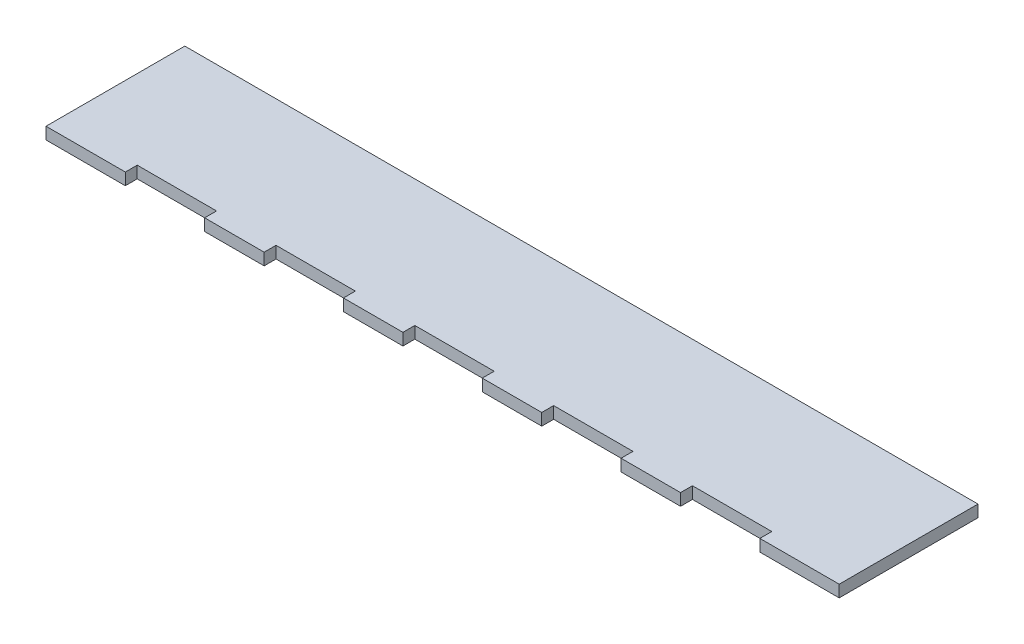
ISO-10303-21;
HEADER;
FILE_DESCRIPTION(('STEP AP214'),'2;1');
FILE_NAME('part.step','',(''),(''),'','','');
FILE_SCHEMA(('AUTOMOTIVE_DESIGN { 1 0 10303 214 1 1 1 1 }'));
ENDSEC;
DATA;
#1=APPLICATION_CONTEXT('core data for automotive mechanical design processes');
#2=APPLICATION_PROTOCOL_DEFINITION('international standard','automotive_design',2000,#1);
#3=PRODUCT_CONTEXT('',#1,'mechanical');
#4=PRODUCT('Part','Part','',(#3));
#5=PRODUCT_RELATED_PRODUCT_CATEGORY('part','',(#4));
#6=PRODUCT_DEFINITION_FORMATION('','',#4);
#7=PRODUCT_DEFINITION_CONTEXT('part definition',#1,'design');
#8=PRODUCT_DEFINITION('design','',#6,#7);
#9=PRODUCT_DEFINITION_SHAPE('','',#8);
#10=(LENGTH_UNIT() NAMED_UNIT(*) SI_UNIT(.MILLI.,.METRE.));
#11=(NAMED_UNIT(*) PLANE_ANGLE_UNIT() SI_UNIT($,.RADIAN.));
#12=(NAMED_UNIT(*) SI_UNIT($,.STERADIAN.) SOLID_ANGLE_UNIT());
#13=UNCERTAINTY_MEASURE_WITH_UNIT(LENGTH_MEASURE(1.E-05),#10,'distance_accuracy_value','');
#14=(GEOMETRIC_REPRESENTATION_CONTEXT(3) GLOBAL_UNCERTAINTY_ASSIGNED_CONTEXT((#13)) GLOBAL_UNIT_ASSIGNED_CONTEXT((#10,
#11,#12)) REPRESENTATION_CONTEXT('',''));
#15=CARTESIAN_POINT('',(0.,0.,0.));
#16=DIRECTION('',(0.,0.,1.));
#17=DIRECTION('',(1.,0.,0.));
#18=AXIS2_PLACEMENT_3D('',#15,#16,#17);
#19=CARTESIAN_POINT('',(0.,3.,0.));
#20=DIRECTION('',(-1.,0.,0.));
#21=DIRECTION('',(0.,0.,1.));
#22=AXIS2_PLACEMENT_3D('',#19,#20,#21);
#23=PLANE('',#22);
#24=DIRECTION('',(0.,0.,-1.));
#25=VECTOR('',#24,1.);
#26=CARTESIAN_POINT('',(0.,0.,0.));
#27=LINE('',#26,#25);
#28=CARTESIAN_POINT('',(0.,0.,0.));
#29=VERTEX_POINT('',#28);
#30=CARTESIAN_POINT('',(0.,0.,-35.));
#31=VERTEX_POINT('',#30);
#32=EDGE_CURVE('E228',#29,#31,#27,.T.);
#33=ORIENTED_EDGE('',*,*,#32,.F.);
#34=DIRECTION('',(0.,-1.,0.));
#35=VECTOR('',#34,1.);
#36=CARTESIAN_POINT('',(0.,3.,0.));
#37=LINE('',#36,#35);
#38=CARTESIAN_POINT('',(0.,3.,0.));
#39=VERTEX_POINT('',#38);
#40=EDGE_CURVE('E11',#39,#29,#37,.T.);
#41=ORIENTED_EDGE('',*,*,#40,.F.);
#42=DIRECTION('',(0.,0.,-1.));
#43=VECTOR('',#42,1.);
#44=CARTESIAN_POINT('',(0.,3.,0.));
#45=LINE('',#44,#43);
#46=CARTESIAN_POINT('',(0.,3.,-35.));
#47=VERTEX_POINT('',#46);
#48=EDGE_CURVE('E285',#39,#47,#45,.T.);
#49=ORIENTED_EDGE('',*,*,#48,.T.);
#50=DIRECTION('',(0.,-1.,0.));
#51=VECTOR('',#50,1.);
#52=CARTESIAN_POINT('',(0.,3.,-35.));
#53=LINE('',#52,#51);
#54=EDGE_CURVE('E36',#47,#31,#53,.T.);
#55=ORIENTED_EDGE('',*,*,#54,.T.);
#56=EDGE_LOOP('',(#33,#41,#49,#55));
#57=FACE_BOUND('',#56,.T.);
#58=ADVANCED_FACE('F33',(#57),#23,.T.);
#59=CARTESIAN_POINT('',(0.,3.,0.));
#60=DIRECTION('',(0.,0.,-1.));
#61=DIRECTION('',(-1.,0.,0.));
#62=AXIS2_PLACEMENT_3D('',#59,#60,#61);
#63=PLANE('',#62);
#64=DIRECTION('',(1.,0.,0.));
#65=VECTOR('',#64,1.);
#66=CARTESIAN_POINT('',(0.,0.,0.));
#67=LINE('',#66,#65);
#68=CARTESIAN_POINT('',(20.,0.,0.));
#69=VERTEX_POINT('',#68);
#70=EDGE_CURVE('E126',#29,#69,#67,.T.);
#71=ORIENTED_EDGE('',*,*,#70,.T.);
#72=DIRECTION('',(0.,-1.,0.));
#73=VECTOR('',#72,1.);
#74=CARTESIAN_POINT('',(20.,3.,0.));
#75=LINE('',#74,#73);
#76=CARTESIAN_POINT('',(20.,3.,0.));
#77=VERTEX_POINT('',#76);
#78=EDGE_CURVE('E42',#77,#69,#75,.T.);
#79=ORIENTED_EDGE('',*,*,#78,.F.);
#80=DIRECTION('',(1.,0.,0.));
#81=VECTOR('',#80,1.);
#82=CARTESIAN_POINT('',(0.,3.,0.));
#83=LINE('',#82,#81);
#84=EDGE_CURVE('E206',#39,#77,#83,.T.);
#85=ORIENTED_EDGE('',*,*,#84,.F.);
#86=ORIENTED_EDGE('',*,*,#40,.T.);
#87=EDGE_LOOP('',(#71,#79,#85,#86));
#88=FACE_BOUND('',#87,.T.);
#89=ADVANCED_FACE('F475',(#88),#63,.F.);
#90=CARTESIAN_POINT('',(20.,3.,0.));
#91=DIRECTION('',(-1.,0.,0.));
#92=DIRECTION('',(0.,0.,1.));
#93=AXIS2_PLACEMENT_3D('',#90,#91,#92);
#94=PLANE('',#93);
#95=DIRECTION('',(0.,0.,-1.));
#96=VECTOR('',#95,1.);
#97=CARTESIAN_POINT('',(20.,0.,0.));
#98=LINE('',#97,#96);
#99=CARTESIAN_POINT('',(20.,0.,-3.));
#100=VERTEX_POINT('',#99);
#101=EDGE_CURVE('E213',#69,#100,#98,.T.);
#102=ORIENTED_EDGE('',*,*,#101,.T.);
#103=DIRECTION('',(0.,-1.,0.));
#104=VECTOR('',#103,1.);
#105=CARTESIAN_POINT('',(20.,3.,-3.));
#106=LINE('',#105,#104);
#107=CARTESIAN_POINT('',(20.,3.,-3.));
#108=VERTEX_POINT('',#107);
#109=EDGE_CURVE('E210',#108,#100,#106,.T.);
#110=ORIENTED_EDGE('',*,*,#109,.F.);
#111=DIRECTION('',(0.,0.,-1.));
#112=VECTOR('',#111,1.);
#113=CARTESIAN_POINT('',(20.,3.,0.));
#114=LINE('',#113,#112);
#115=EDGE_CURVE('E198',#77,#108,#114,.T.);
#116=ORIENTED_EDGE('',*,*,#115,.F.);
#117=ORIENTED_EDGE('',*,*,#78,.T.);
#118=EDGE_LOOP('',(#102,#110,#116,#117));
#119=FACE_BOUND('',#118,.T.);
#120=ADVANCED_FACE('F211',(#119),#94,.F.);
#121=CARTESIAN_POINT('',(20.,3.,-3.));
#122=DIRECTION('',(0.,0.,-1.));
#123=DIRECTION('',(-1.,0.,0.));
#124=AXIS2_PLACEMENT_3D('',#121,#122,#123);
#125=PLANE('',#124);
#126=DIRECTION('',(1.,0.,0.));
#127=VECTOR('',#126,1.);
#128=CARTESIAN_POINT('',(20.,0.,-3.));
#129=LINE('',#128,#127);
#130=CARTESIAN_POINT('',(40.,0.,-3.));
#131=VERTEX_POINT('',#130);
#132=EDGE_CURVE('E282',#100,#131,#129,.T.);
#133=ORIENTED_EDGE('',*,*,#132,.T.);
#134=DIRECTION('',(0.,-1.,0.));
#135=VECTOR('',#134,1.);
#136=CARTESIAN_POINT('',(40.,3.,-3.));
#137=LINE('',#136,#135);
#138=CARTESIAN_POINT('',(40.,3.,-3.));
#139=VERTEX_POINT('',#138);
#140=EDGE_CURVE('E217',#139,#131,#137,.T.);
#141=ORIENTED_EDGE('',*,*,#140,.F.);
#142=DIRECTION('',(1.,0.,0.));
#143=VECTOR('',#142,1.);
#144=CARTESIAN_POINT('',(20.,3.,-3.));
#145=LINE('',#144,#143);
#146=EDGE_CURVE('E204',#108,#139,#145,.T.);
#147=ORIENTED_EDGE('',*,*,#146,.F.);
#148=ORIENTED_EDGE('',*,*,#109,.T.);
#149=EDGE_LOOP('',(#133,#141,#147,#148));
#150=FACE_BOUND('',#149,.T.);
#151=ADVANCED_FACE('F219',(#150),#125,.F.);
#152=CARTESIAN_POINT('',(40.,3.,0.));
#153=DIRECTION('',(-1.,0.,0.));
#154=DIRECTION('',(0.,0.,1.));
#155=AXIS2_PLACEMENT_3D('',#152,#153,#154);
#156=PLANE('',#155);
#157=DIRECTION('',(0.,0.,-1.));
#158=VECTOR('',#157,1.);
#159=CARTESIAN_POINT('',(40.,0.,0.));
#160=LINE('',#159,#158);
#161=CARTESIAN_POINT('',(40.,0.,0.));
#162=VERTEX_POINT('',#161);
#163=EDGE_CURVE('E279',#162,#131,#160,.T.);
#164=ORIENTED_EDGE('',*,*,#163,.F.);
#165=DIRECTION('',(0.,-1.,0.));
#166=VECTOR('',#165,1.);
#167=CARTESIAN_POINT('',(40.,3.,0.));
#168=LINE('',#167,#166);
#169=CARTESIAN_POINT('',(40.,3.,0.));
#170=VERTEX_POINT('',#169);
#171=EDGE_CURVE('E289',#170,#162,#168,.T.);
#172=ORIENTED_EDGE('',*,*,#171,.F.);
#173=DIRECTION('',(0.,0.,-1.));
#174=VECTOR('',#173,1.);
#175=CARTESIAN_POINT('',(40.,3.,0.));
#176=LINE('',#175,#174);
#177=EDGE_CURVE('E221',#170,#139,#176,.T.);
#178=ORIENTED_EDGE('',*,*,#177,.T.);
#179=ORIENTED_EDGE('',*,*,#140,.T.);
#180=EDGE_LOOP('',(#164,#172,#178,#179));
#181=FACE_BOUND('',#180,.T.);
#182=ADVANCED_FACE('F343',(#181),#156,.T.);
#183=CARTESIAN_POINT('',(40.,3.,0.));
#184=DIRECTION('',(0.,0.,-1.));
#185=DIRECTION('',(-1.,0.,0.));
#186=AXIS2_PLACEMENT_3D('',#183,#184,#185);
#187=PLANE('',#186);
#188=DIRECTION('',(1.,0.,0.));
#189=VECTOR('',#188,1.);
#190=CARTESIAN_POINT('',(40.,0.,0.));
#191=LINE('',#190,#189);
#192=CARTESIAN_POINT('',(55.,0.,0.));
#193=VERTEX_POINT('',#192);
#194=EDGE_CURVE('E277',#162,#193,#191,.T.);
#195=ORIENTED_EDGE('',*,*,#194,.T.);
#196=DIRECTION('',(0.,-1.,0.));
#197=VECTOR('',#196,1.);
#198=CARTESIAN_POINT('',(55.,3.,0.));
#199=LINE('',#198,#197);
#200=CARTESIAN_POINT('',(55.,3.,0.));
#201=VERTEX_POINT('',#200);
#202=EDGE_CURVE('E291',#201,#193,#199,.T.);
#203=ORIENTED_EDGE('',*,*,#202,.F.);
#204=DIRECTION('',(1.,0.,0.));
#205=VECTOR('',#204,1.);
#206=CARTESIAN_POINT('',(40.,3.,0.));
#207=LINE('',#206,#205);
#208=EDGE_CURVE('E223',#170,#201,#207,.T.);
#209=ORIENTED_EDGE('',*,*,#208,.F.);
#210=ORIENTED_EDGE('',*,*,#171,.T.);
#211=EDGE_LOOP('',(#195,#203,#209,#210));
#212=FACE_BOUND('',#211,.T.);
#213=ADVANCED_FACE('F350',(#212),#187,.F.);
#214=CARTESIAN_POINT('',(55.,3.,0.));
#215=DIRECTION('',(-1.,0.,0.));
#216=DIRECTION('',(0.,0.,1.));
#217=AXIS2_PLACEMENT_3D('',#214,#215,#216);
#218=PLANE('',#217);
#219=DIRECTION('',(0.,0.,-1.));
#220=VECTOR('',#219,1.);
#221=CARTESIAN_POINT('',(55.,0.,0.));
#222=LINE('',#221,#220);
#223=CARTESIAN_POINT('',(55.,0.,-3.));
#224=VERTEX_POINT('',#223);
#225=EDGE_CURVE('E275',#193,#224,#222,.T.);
#226=ORIENTED_EDGE('',*,*,#225,.T.);
#227=DIRECTION('',(0.,-1.,0.));
#228=VECTOR('',#227,1.);
#229=CARTESIAN_POINT('',(55.,3.,-3.));
#230=LINE('',#229,#228);
#231=CARTESIAN_POINT('',(55.,3.,-3.));
#232=VERTEX_POINT('',#231);
#233=EDGE_CURVE('E294',#232,#224,#230,.T.);
#234=ORIENTED_EDGE('',*,*,#233,.F.);
#235=DIRECTION('',(0.,0.,-1.));
#236=VECTOR('',#235,1.);
#237=CARTESIAN_POINT('',(55.,3.,0.));
#238=LINE('',#237,#236);
#239=EDGE_CURVE('E347',#201,#232,#238,.T.);
#240=ORIENTED_EDGE('',*,*,#239,.F.);
#241=ORIENTED_EDGE('',*,*,#202,.T.);
#242=EDGE_LOOP('',(#226,#234,#240,#241));
#243=FACE_BOUND('',#242,.T.);
#244=ADVANCED_FACE('F352',(#243),#218,.F.);
#245=CARTESIAN_POINT('',(55.,3.,-3.));
#246=DIRECTION('',(0.,0.,-1.));
#247=DIRECTION('',(-1.,0.,0.));
#248=AXIS2_PLACEMENT_3D('',#245,#246,#247);
#249=PLANE('',#248);
#250=DIRECTION('',(1.,0.,0.));
#251=VECTOR('',#250,1.);
#252=CARTESIAN_POINT('',(55.,0.,-3.));
#253=LINE('',#252,#251);
#254=CARTESIAN_POINT('',(75.,0.,-3.));
#255=VERTEX_POINT('',#254);
#256=EDGE_CURVE('E272',#224,#255,#253,.T.);
#257=ORIENTED_EDGE('',*,*,#256,.T.);
#258=DIRECTION('',(0.,-1.,0.));
#259=VECTOR('',#258,1.);
#260=CARTESIAN_POINT('',(75.,3.,-3.));
#261=LINE('',#260,#259);
#262=CARTESIAN_POINT('',(75.,3.,-3.));
#263=VERTEX_POINT('',#262);
#264=EDGE_CURVE('E297',#263,#255,#261,.T.);
#265=ORIENTED_EDGE('',*,*,#264,.F.);
#266=DIRECTION('',(1.,0.,0.));
#267=VECTOR('',#266,1.);
#268=CARTESIAN_POINT('',(55.,3.,-3.));
#269=LINE('',#268,#267);
#270=EDGE_CURVE('E354',#232,#263,#269,.T.);
#271=ORIENTED_EDGE('',*,*,#270,.F.);
#272=ORIENTED_EDGE('',*,*,#233,.T.);
#273=EDGE_LOOP('',(#257,#265,#271,#272));
#274=FACE_BOUND('',#273,.T.);
#275=ADVANCED_FACE('F465',(#274),#249,.F.);
#276=CARTESIAN_POINT('',(75.,3.,0.));
#277=DIRECTION('',(-1.,0.,0.));
#278=DIRECTION('',(0.,0.,1.));
#279=AXIS2_PLACEMENT_3D('',#276,#277,#278);
#280=PLANE('',#279);
#281=DIRECTION('',(0.,0.,-1.));
#282=VECTOR('',#281,1.);
#283=CARTESIAN_POINT('',(75.,0.,0.));
#284=LINE('',#283,#282);
#285=CARTESIAN_POINT('',(75.,0.,0.));
#286=VERTEX_POINT('',#285);
#287=EDGE_CURVE('E269',#286,#255,#284,.T.);
#288=ORIENTED_EDGE('',*,*,#287,.F.);
#289=DIRECTION('',(0.,-1.,0.));
#290=VECTOR('',#289,1.);
#291=CARTESIAN_POINT('',(75.,3.,0.));
#292=LINE('',#291,#290);
#293=CARTESIAN_POINT('',(75.,3.,0.));
#294=VERTEX_POINT('',#293);
#295=EDGE_CURVE('E299',#294,#286,#292,.T.);
#296=ORIENTED_EDGE('',*,*,#295,.F.);
#297=DIRECTION('',(0.,0.,-1.));
#298=VECTOR('',#297,1.);
#299=CARTESIAN_POINT('',(75.,3.,0.));
#300=LINE('',#299,#298);
#301=EDGE_CURVE('E356',#294,#263,#300,.T.);
#302=ORIENTED_EDGE('',*,*,#301,.T.);
#303=ORIENTED_EDGE('',*,*,#264,.T.);
#304=EDGE_LOOP('',(#288,#296,#302,#303));
#305=FACE_BOUND('',#304,.T.);
#306=ADVANCED_FACE('F461',(#305),#280,.T.);
#307=CARTESIAN_POINT('',(75.,3.,0.));
#308=DIRECTION('',(0.,0.,-1.));
#309=DIRECTION('',(-1.,0.,0.));
#310=AXIS2_PLACEMENT_3D('',#307,#308,#309);
#311=PLANE('',#310);
#312=DIRECTION('',(1.,0.,0.));
#313=VECTOR('',#312,1.);
#314=CARTESIAN_POINT('',(75.,0.,0.));
#315=LINE('',#314,#313);
#316=CARTESIAN_POINT('',(90.,0.,0.));
#317=VERTEX_POINT('',#316);
#318=EDGE_CURVE('E267',#286,#317,#315,.T.);
#319=ORIENTED_EDGE('',*,*,#318,.T.);
#320=DIRECTION('',(0.,-1.,0.));
#321=VECTOR('',#320,1.);
#322=CARTESIAN_POINT('',(90.,3.,0.));
#323=LINE('',#322,#321);
#324=CARTESIAN_POINT('',(90.,3.,0.));
#325=VERTEX_POINT('',#324);
#326=EDGE_CURVE('E301',#325,#317,#323,.T.);
#327=ORIENTED_EDGE('',*,*,#326,.F.);
#328=DIRECTION('',(1.,0.,0.));
#329=VECTOR('',#328,1.);
#330=CARTESIAN_POINT('',(75.,3.,0.));
#331=LINE('',#330,#329);
#332=EDGE_CURVE('E361',#294,#325,#331,.T.);
#333=ORIENTED_EDGE('',*,*,#332,.F.);
#334=ORIENTED_EDGE('',*,*,#295,.T.);
#335=EDGE_LOOP('',(#319,#327,#333,#334));
#336=FACE_BOUND('',#335,.T.);
#337=ADVANCED_FACE('F458',(#336),#311,.F.);
#338=CARTESIAN_POINT('',(90.,3.,0.));
#339=DIRECTION('',(-1.,0.,0.));
#340=DIRECTION('',(0.,0.,1.));
#341=AXIS2_PLACEMENT_3D('',#338,#339,#340);
#342=PLANE('',#341);
#343=DIRECTION('',(0.,0.,-1.));
#344=VECTOR('',#343,1.);
#345=CARTESIAN_POINT('',(90.,0.,0.));
#346=LINE('',#345,#344);
#347=CARTESIAN_POINT('',(90.,0.,-3.));
#348=VERTEX_POINT('',#347);
#349=EDGE_CURVE('E265',#317,#348,#346,.T.);
#350=ORIENTED_EDGE('',*,*,#349,.T.);
#351=DIRECTION('',(0.,-1.,0.));
#352=VECTOR('',#351,1.);
#353=CARTESIAN_POINT('',(90.,3.,-3.));
#354=LINE('',#353,#352);
#355=CARTESIAN_POINT('',(90.,3.,-3.));
#356=VERTEX_POINT('',#355);
#357=EDGE_CURVE('E304',#356,#348,#354,.T.);
#358=ORIENTED_EDGE('',*,*,#357,.F.);
#359=DIRECTION('',(0.,0.,-1.));
#360=VECTOR('',#359,1.);
#361=CARTESIAN_POINT('',(90.,3.,0.));
#362=LINE('',#361,#360);
#363=EDGE_CURVE('E363',#325,#356,#362,.T.);
#364=ORIENTED_EDGE('',*,*,#363,.F.);
#365=ORIENTED_EDGE('',*,*,#326,.T.);
#366=EDGE_LOOP('',(#350,#358,#364,#365));
#367=FACE_BOUND('',#366,.T.);
#368=ADVANCED_FACE('F453',(#367),#342,.F.);
#369=CARTESIAN_POINT('',(90.,3.,-3.));
#370=DIRECTION('',(0.,0.,-1.));
#371=DIRECTION('',(-1.,0.,0.));
#372=AXIS2_PLACEMENT_3D('',#369,#370,#371);
#373=PLANE('',#372);
#374=DIRECTION('',(1.,0.,0.));
#375=VECTOR('',#374,1.);
#376=CARTESIAN_POINT('',(90.,0.,-3.));
#377=LINE('',#376,#375);
#378=CARTESIAN_POINT('',(110.,0.,-3.));
#379=VERTEX_POINT('',#378);
#380=EDGE_CURVE('E262',#348,#379,#377,.T.);
#381=ORIENTED_EDGE('',*,*,#380,.T.);
#382=DIRECTION('',(0.,-1.,0.));
#383=VECTOR('',#382,1.);
#384=CARTESIAN_POINT('',(110.,3.,-3.));
#385=LINE('',#384,#383);
#386=CARTESIAN_POINT('',(110.,3.,-3.));
#387=VERTEX_POINT('',#386);
#388=EDGE_CURVE('E307',#387,#379,#385,.T.);
#389=ORIENTED_EDGE('',*,*,#388,.F.);
#390=DIRECTION('',(1.,0.,0.));
#391=VECTOR('',#390,1.);
#392=CARTESIAN_POINT('',(90.,3.,-3.));
#393=LINE('',#392,#391);
#394=EDGE_CURVE('E365',#356,#387,#393,.T.);
#395=ORIENTED_EDGE('',*,*,#394,.F.);
#396=ORIENTED_EDGE('',*,*,#357,.T.);
#397=EDGE_LOOP('',(#381,#389,#395,#396));
#398=FACE_BOUND('',#397,.T.);
#399=ADVANCED_FACE('F447',(#398),#373,.F.);
#400=CARTESIAN_POINT('',(110.,3.,0.));
#401=DIRECTION('',(-1.,0.,0.));
#402=DIRECTION('',(0.,0.,1.));
#403=AXIS2_PLACEMENT_3D('',#400,#401,#402);
#404=PLANE('',#403);
#405=DIRECTION('',(0.,0.,-1.));
#406=VECTOR('',#405,1.);
#407=CARTESIAN_POINT('',(110.,0.,0.));
#408=LINE('',#407,#406);
#409=CARTESIAN_POINT('',(110.,0.,0.));
#410=VERTEX_POINT('',#409);
#411=EDGE_CURVE('E259',#410,#379,#408,.T.);
#412=ORIENTED_EDGE('',*,*,#411,.F.);
#413=DIRECTION('',(0.,-1.,0.));
#414=VECTOR('',#413,1.);
#415=CARTESIAN_POINT('',(110.,3.,0.));
#416=LINE('',#415,#414);
#417=CARTESIAN_POINT('',(110.,3.,0.));
#418=VERTEX_POINT('',#417);
#419=EDGE_CURVE('E309',#418,#410,#416,.T.);
#420=ORIENTED_EDGE('',*,*,#419,.F.);
#421=DIRECTION('',(0.,0.,-1.));
#422=VECTOR('',#421,1.);
#423=CARTESIAN_POINT('',(110.,3.,0.));
#424=LINE('',#423,#422);
#425=EDGE_CURVE('E367',#418,#387,#424,.T.);
#426=ORIENTED_EDGE('',*,*,#425,.T.);
#427=ORIENTED_EDGE('',*,*,#388,.T.);
#428=EDGE_LOOP('',(#412,#420,#426,#427));
#429=FACE_BOUND('',#428,.T.);
#430=ADVANCED_FACE('F443',(#429),#404,.T.);
#431=CARTESIAN_POINT('',(110.,3.,0.));
#432=DIRECTION('',(0.,0.,-1.));
#433=DIRECTION('',(-1.,0.,0.));
#434=AXIS2_PLACEMENT_3D('',#431,#432,#433);
#435=PLANE('',#434);
#436=DIRECTION('',(1.,0.,0.));
#437=VECTOR('',#436,1.);
#438=CARTESIAN_POINT('',(110.,0.,0.));
#439=LINE('',#438,#437);
#440=CARTESIAN_POINT('',(125.,0.,0.));
#441=VERTEX_POINT('',#440);
#442=EDGE_CURVE('E257',#410,#441,#439,.T.);
#443=ORIENTED_EDGE('',*,*,#442,.T.);
#444=DIRECTION('',(0.,-1.,0.));
#445=VECTOR('',#444,1.);
#446=CARTESIAN_POINT('',(125.,3.,0.));
#447=LINE('',#446,#445);
#448=CARTESIAN_POINT('',(125.,3.,0.));
#449=VERTEX_POINT('',#448);
#450=EDGE_CURVE('E311',#449,#441,#447,.T.);
#451=ORIENTED_EDGE('',*,*,#450,.F.);
#452=DIRECTION('',(1.,0.,0.));
#453=VECTOR('',#452,1.);
#454=CARTESIAN_POINT('',(110.,3.,0.));
#455=LINE('',#454,#453);
#456=EDGE_CURVE('E370',#418,#449,#455,.T.);
#457=ORIENTED_EDGE('',*,*,#456,.F.);
#458=ORIENTED_EDGE('',*,*,#419,.T.);
#459=EDGE_LOOP('',(#443,#451,#457,#458));
#460=FACE_BOUND('',#459,.T.);
#461=ADVANCED_FACE('F438',(#460),#435,.F.);
#462=CARTESIAN_POINT('',(125.,3.,0.));
#463=DIRECTION('',(-1.,0.,0.));
#464=DIRECTION('',(0.,0.,1.));
#465=AXIS2_PLACEMENT_3D('',#462,#463,#464);
#466=PLANE('',#465);
#467=DIRECTION('',(0.,0.,-1.));
#468=VECTOR('',#467,1.);
#469=CARTESIAN_POINT('',(125.,0.,0.));
#470=LINE('',#469,#468);
#471=CARTESIAN_POINT('',(125.,0.,-3.));
#472=VERTEX_POINT('',#471);
#473=EDGE_CURVE('E255',#441,#472,#470,.T.);
#474=ORIENTED_EDGE('',*,*,#473,.T.);
#475=DIRECTION('',(0.,-1.,0.));
#476=VECTOR('',#475,1.);
#477=CARTESIAN_POINT('',(125.,3.,-3.));
#478=LINE('',#477,#476);
#479=CARTESIAN_POINT('',(125.,3.,-3.));
#480=VERTEX_POINT('',#479);
#481=EDGE_CURVE('E314',#480,#472,#478,.T.);
#482=ORIENTED_EDGE('',*,*,#481,.F.);
#483=DIRECTION('',(0.,0.,-1.));
#484=VECTOR('',#483,1.);
#485=CARTESIAN_POINT('',(125.,3.,0.));
#486=LINE('',#485,#484);
#487=EDGE_CURVE('E372',#449,#480,#486,.T.);
#488=ORIENTED_EDGE('',*,*,#487,.F.);
#489=ORIENTED_EDGE('',*,*,#450,.T.);
#490=EDGE_LOOP('',(#474,#482,#488,#489));
#491=FACE_BOUND('',#490,.T.);
#492=ADVANCED_FACE('F434',(#491),#466,.F.);
#493=CARTESIAN_POINT('',(125.,3.,-3.));
#494=DIRECTION('',(0.,0.,-1.));
#495=DIRECTION('',(-1.,0.,0.));
#496=AXIS2_PLACEMENT_3D('',#493,#494,#495);
#497=PLANE('',#496);
#498=DIRECTION('',(1.,0.,0.));
#499=VECTOR('',#498,1.);
#500=CARTESIAN_POINT('',(125.,0.,-3.));
#501=LINE('',#500,#499);
#502=CARTESIAN_POINT('',(145.,0.,-3.));
#503=VERTEX_POINT('',#502);
#504=EDGE_CURVE('E252',#472,#503,#501,.T.);
#505=ORIENTED_EDGE('',*,*,#504,.T.);
#506=DIRECTION('',(0.,-1.,0.));
#507=VECTOR('',#506,1.);
#508=CARTESIAN_POINT('',(145.,3.,-3.));
#509=LINE('',#508,#507);
#510=CARTESIAN_POINT('',(145.,3.,-3.));
#511=VERTEX_POINT('',#510);
#512=EDGE_CURVE('E317',#511,#503,#509,.T.);
#513=ORIENTED_EDGE('',*,*,#512,.F.);
#514=DIRECTION('',(1.,0.,0.));
#515=VECTOR('',#514,1.);
#516=CARTESIAN_POINT('',(125.,3.,-3.));
#517=LINE('',#516,#515);
#518=EDGE_CURVE('E374',#480,#511,#517,.T.);
#519=ORIENTED_EDGE('',*,*,#518,.F.);
#520=ORIENTED_EDGE('',*,*,#481,.T.);
#521=EDGE_LOOP('',(#505,#513,#519,#520));
#522=FACE_BOUND('',#521,.T.);
#523=ADVANCED_FACE('F429',(#522),#497,.F.);
#524=CARTESIAN_POINT('',(145.,3.,0.));
#525=DIRECTION('',(-1.,0.,0.));
#526=DIRECTION('',(0.,0.,1.));
#527=AXIS2_PLACEMENT_3D('',#524,#525,#526);
#528=PLANE('',#527);
#529=DIRECTION('',(0.,0.,-1.));
#530=VECTOR('',#529,1.);
#531=CARTESIAN_POINT('',(145.,0.,0.));
#532=LINE('',#531,#530);
#533=CARTESIAN_POINT('',(145.,0.,0.));
#534=VERTEX_POINT('',#533);
#535=EDGE_CURVE('E249',#534,#503,#532,.T.);
#536=ORIENTED_EDGE('',*,*,#535,.F.);
#537=DIRECTION('',(0.,-1.,0.));
#538=VECTOR('',#537,1.);
#539=CARTESIAN_POINT('',(145.,3.,0.));
#540=LINE('',#539,#538);
#541=CARTESIAN_POINT('',(145.,3.,0.));
#542=VERTEX_POINT('',#541);
#543=EDGE_CURVE('E319',#542,#534,#540,.T.);
#544=ORIENTED_EDGE('',*,*,#543,.F.);
#545=DIRECTION('',(0.,0.,-1.));
#546=VECTOR('',#545,1.);
#547=CARTESIAN_POINT('',(145.,3.,0.));
#548=LINE('',#547,#546);
#549=EDGE_CURVE('E376',#542,#511,#548,.T.);
#550=ORIENTED_EDGE('',*,*,#549,.T.);
#551=ORIENTED_EDGE('',*,*,#512,.T.);
#552=EDGE_LOOP('',(#536,#544,#550,#551));
#553=FACE_BOUND('',#552,.T.);
#554=ADVANCED_FACE('F423',(#553),#528,.T.);
#555=CARTESIAN_POINT('',(145.,3.,0.));
#556=DIRECTION('',(0.,0.,-1.));
#557=DIRECTION('',(-1.,0.,0.));
#558=AXIS2_PLACEMENT_3D('',#555,#556,#557);
#559=PLANE('',#558);
#560=DIRECTION('',(1.,0.,0.));
#561=VECTOR('',#560,1.);
#562=CARTESIAN_POINT('',(145.,0.,0.));
#563=LINE('',#562,#561);
#564=CARTESIAN_POINT('',(160.,0.,0.));
#565=VERTEX_POINT('',#564);
#566=EDGE_CURVE('E247',#534,#565,#563,.T.);
#567=ORIENTED_EDGE('',*,*,#566,.T.);
#568=DIRECTION('',(0.,-1.,0.));
#569=VECTOR('',#568,1.);
#570=CARTESIAN_POINT('',(160.,3.,0.));
#571=LINE('',#570,#569);
#572=CARTESIAN_POINT('',(160.,3.,0.));
#573=VERTEX_POINT('',#572);
#574=EDGE_CURVE('E321',#573,#565,#571,.T.);
#575=ORIENTED_EDGE('',*,*,#574,.F.);
#576=DIRECTION('',(1.,0.,0.));
#577=VECTOR('',#576,1.);
#578=CARTESIAN_POINT('',(145.,3.,0.));
#579=LINE('',#578,#577);
#580=EDGE_CURVE('E379',#542,#573,#579,.T.);
#581=ORIENTED_EDGE('',*,*,#580,.F.);
#582=ORIENTED_EDGE('',*,*,#543,.T.);
#583=EDGE_LOOP('',(#567,#575,#581,#582));
#584=FACE_BOUND('',#583,.T.);
#585=ADVANCED_FACE('F420',(#584),#559,.F.);
#586=CARTESIAN_POINT('',(160.,3.,0.));
#587=DIRECTION('',(-1.,0.,0.));
#588=DIRECTION('',(0.,0.,1.));
#589=AXIS2_PLACEMENT_3D('',#586,#587,#588);
#590=PLANE('',#589);
#591=DIRECTION('',(0.,0.,-1.));
#592=VECTOR('',#591,1.);
#593=CARTESIAN_POINT('',(160.,0.,0.));
#594=LINE('',#593,#592);
#595=CARTESIAN_POINT('',(160.,0.,-3.));
#596=VERTEX_POINT('',#595);
#597=EDGE_CURVE('E245',#565,#596,#594,.T.);
#598=ORIENTED_EDGE('',*,*,#597,.T.);
#599=DIRECTION('',(0.,-1.,0.));
#600=VECTOR('',#599,1.);
#601=CARTESIAN_POINT('',(160.,3.,-3.));
#602=LINE('',#601,#600);
#603=CARTESIAN_POINT('',(160.,3.,-3.));
#604=VERTEX_POINT('',#603);
#605=EDGE_CURVE('E324',#604,#596,#602,.T.);
#606=ORIENTED_EDGE('',*,*,#605,.F.);
#607=DIRECTION('',(0.,0.,-1.));
#608=VECTOR('',#607,1.);
#609=CARTESIAN_POINT('',(160.,3.,0.));
#610=LINE('',#609,#608);
#611=EDGE_CURVE('E381',#573,#604,#610,.T.);
#612=ORIENTED_EDGE('',*,*,#611,.F.);
#613=ORIENTED_EDGE('',*,*,#574,.T.);
#614=EDGE_LOOP('',(#598,#606,#612,#613));
#615=FACE_BOUND('',#614,.T.);
#616=ADVANCED_FACE('F415',(#615),#590,.F.);
#617=CARTESIAN_POINT('',(160.,3.,-3.));
#618=DIRECTION('',(0.,0.,-1.));
#619=DIRECTION('',(-1.,0.,0.));
#620=AXIS2_PLACEMENT_3D('',#617,#618,#619);
#621=PLANE('',#620);
#622=DIRECTION('',(1.,0.,0.));
#623=VECTOR('',#622,1.);
#624=CARTESIAN_POINT('',(160.,0.,-3.));
#625=LINE('',#624,#623);
#626=CARTESIAN_POINT('',(180.,0.,-3.));
#627=VERTEX_POINT('',#626);
#628=EDGE_CURVE('E242',#596,#627,#625,.T.);
#629=ORIENTED_EDGE('',*,*,#628,.T.);
#630=DIRECTION('',(0.,-1.,0.));
#631=VECTOR('',#630,1.);
#632=CARTESIAN_POINT('',(180.,3.,-3.));
#633=LINE('',#632,#631);
#634=CARTESIAN_POINT('',(180.,3.,-3.));
#635=VERTEX_POINT('',#634);
#636=EDGE_CURVE('E327',#635,#627,#633,.T.);
#637=ORIENTED_EDGE('',*,*,#636,.F.);
#638=DIRECTION('',(1.,0.,0.));
#639=VECTOR('',#638,1.);
#640=CARTESIAN_POINT('',(160.,3.,-3.));
#641=LINE('',#640,#639);
#642=EDGE_CURVE('E383',#604,#635,#641,.T.);
#643=ORIENTED_EDGE('',*,*,#642,.F.);
#644=ORIENTED_EDGE('',*,*,#605,.T.);
#645=EDGE_LOOP('',(#629,#637,#643,#644));
#646=FACE_BOUND('',#645,.T.);
#647=ADVANCED_FACE('F409',(#646),#621,.F.);
#648=CARTESIAN_POINT('',(180.,3.,0.));
#649=DIRECTION('',(-1.,0.,0.));
#650=DIRECTION('',(0.,0.,1.));
#651=AXIS2_PLACEMENT_3D('',#648,#649,#650);
#652=PLANE('',#651);
#653=DIRECTION('',(0.,0.,-1.));
#654=VECTOR('',#653,1.);
#655=CARTESIAN_POINT('',(180.,0.,0.));
#656=LINE('',#655,#654);
#657=CARTESIAN_POINT('',(180.,0.,0.));
#658=VERTEX_POINT('',#657);
#659=EDGE_CURVE('E239',#658,#627,#656,.T.);
#660=ORIENTED_EDGE('',*,*,#659,.F.);
#661=DIRECTION('',(0.,-1.,0.));
#662=VECTOR('',#661,1.);
#663=CARTESIAN_POINT('',(180.,3.,0.));
#664=LINE('',#663,#662);
#665=CARTESIAN_POINT('',(180.,3.,0.));
#666=VERTEX_POINT('',#665);
#667=EDGE_CURVE('E329',#666,#658,#664,.T.);
#668=ORIENTED_EDGE('',*,*,#667,.F.);
#669=DIRECTION('',(0.,0.,-1.));
#670=VECTOR('',#669,1.);
#671=CARTESIAN_POINT('',(180.,3.,0.));
#672=LINE('',#671,#670);
#673=EDGE_CURVE('E385',#666,#635,#672,.T.);
#674=ORIENTED_EDGE('',*,*,#673,.T.);
#675=ORIENTED_EDGE('',*,*,#636,.T.);
#676=EDGE_LOOP('',(#660,#668,#674,#675));
#677=FACE_BOUND('',#676,.T.);
#678=ADVANCED_FACE('F405',(#677),#652,.T.);
#679=CARTESIAN_POINT('',(180.,3.,0.));
#680=DIRECTION('',(0.,0.,-1.));
#681=DIRECTION('',(-1.,0.,0.));
#682=AXIS2_PLACEMENT_3D('',#679,#680,#681);
#683=PLANE('',#682);
#684=DIRECTION('',(1.,0.,0.));
#685=VECTOR('',#684,1.);
#686=CARTESIAN_POINT('',(180.,0.,0.));
#687=LINE('',#686,#685);
#688=CARTESIAN_POINT('',(200.,0.,0.));
#689=VERTEX_POINT('',#688);
#690=EDGE_CURVE('E237',#658,#689,#687,.T.);
#691=ORIENTED_EDGE('',*,*,#690,.T.);
#692=DIRECTION('',(0.,-1.,0.));
#693=VECTOR('',#692,1.);
#694=CARTESIAN_POINT('',(200.,3.,0.));
#695=LINE('',#694,#693);
#696=CARTESIAN_POINT('',(200.,3.,0.));
#697=VERTEX_POINT('',#696);
#698=EDGE_CURVE('E331',#697,#689,#695,.T.);
#699=ORIENTED_EDGE('',*,*,#698,.F.);
#700=DIRECTION('',(1.,0.,0.));
#701=VECTOR('',#700,1.);
#702=CARTESIAN_POINT('',(180.,3.,0.));
#703=LINE('',#702,#701);
#704=EDGE_CURVE('E388',#666,#697,#703,.T.);
#705=ORIENTED_EDGE('',*,*,#704,.F.);
#706=ORIENTED_EDGE('',*,*,#667,.T.);
#707=EDGE_LOOP('',(#691,#699,#705,#706));
#708=FACE_BOUND('',#707,.T.);
#709=ADVANCED_FACE('F607',(#708),#683,.F.);
#710=CARTESIAN_POINT('',(200.,3.,0.));
#711=DIRECTION('',(-1.,0.,0.));
#712=DIRECTION('',(0.,0.,1.));
#713=AXIS2_PLACEMENT_3D('',#710,#711,#712);
#714=PLANE('',#713);
#715=DIRECTION('',(0.,0.,-1.));
#716=VECTOR('',#715,1.);
#717=CARTESIAN_POINT('',(200.,0.,0.));
#718=LINE('',#717,#716);
#719=CARTESIAN_POINT('',(200.,0.,-35.));
#720=VERTEX_POINT('',#719);
#721=EDGE_CURVE('E234',#689,#720,#718,.T.);
#722=ORIENTED_EDGE('',*,*,#721,.T.);
#723=DIRECTION('',(0.,-1.,0.));
#724=VECTOR('',#723,1.);
#725=CARTESIAN_POINT('',(200.,3.,-35.));
#726=LINE('',#725,#724);
#727=CARTESIAN_POINT('',(200.,3.,-35.));
#728=VERTEX_POINT('',#727);
#729=EDGE_CURVE('E333',#728,#720,#726,.T.);
#730=ORIENTED_EDGE('',*,*,#729,.F.);
#731=DIRECTION('',(0.,0.,-1.));
#732=VECTOR('',#731,1.);
#733=CARTESIAN_POINT('',(200.,3.,0.));
#734=LINE('',#733,#732);
#735=EDGE_CURVE('E390',#697,#728,#734,.T.);
#736=ORIENTED_EDGE('',*,*,#735,.F.);
#737=ORIENTED_EDGE('',*,*,#698,.T.);
#738=EDGE_LOOP('',(#722,#730,#736,#737));
#739=FACE_BOUND('',#738,.T.);
#740=ADVANCED_FACE('F399',(#739),#714,.F.);
#741=CARTESIAN_POINT('',(0.,3.,-35.));
#742=DIRECTION('',(0.,0.,-1.));
#743=DIRECTION('',(-1.,0.,0.));
#744=AXIS2_PLACEMENT_3D('',#741,#742,#743);
#745=PLANE('',#744);
#746=DIRECTION('',(1.,0.,0.));
#747=VECTOR('',#746,1.);
#748=CARTESIAN_POINT('',(0.,0.,-35.));
#749=LINE('',#748,#747);
#750=EDGE_CURVE('E231',#31,#720,#749,.T.);
#751=ORIENTED_EDGE('',*,*,#750,.F.);
#752=ORIENTED_EDGE('',*,*,#54,.F.);
#753=DIRECTION('',(1.,0.,0.));
#754=VECTOR('',#753,1.);
#755=CARTESIAN_POINT('',(0.,3.,-35.));
#756=LINE('',#755,#754);
#757=EDGE_CURVE('E392',#47,#728,#756,.T.);
#758=ORIENTED_EDGE('',*,*,#757,.T.);
#759=ORIENTED_EDGE('',*,*,#729,.T.);
#760=EDGE_LOOP('',(#751,#752,#758,#759));
#761=FACE_BOUND('',#760,.T.);
#762=ADVANCED_FACE('F335',(#761),#745,.T.);
#763=CARTESIAN_POINT('',(0.,3.,0.));
#764=DIRECTION('',(0.,-1.,0.));
#765=DIRECTION('',(0.,0.,-1.));
#766=AXIS2_PLACEMENT_3D('',#763,#764,#765);
#767=PLANE('',#766);
#768=ORIENTED_EDGE('',*,*,#48,.F.);
#769=ORIENTED_EDGE('',*,*,#84,.T.);
#770=ORIENTED_EDGE('',*,*,#115,.T.);
#771=ORIENTED_EDGE('',*,*,#146,.T.);
#772=ORIENTED_EDGE('',*,*,#177,.F.);
#773=ORIENTED_EDGE('',*,*,#208,.T.);
#774=ORIENTED_EDGE('',*,*,#239,.T.);
#775=ORIENTED_EDGE('',*,*,#270,.T.);
#776=ORIENTED_EDGE('',*,*,#301,.F.);
#777=ORIENTED_EDGE('',*,*,#332,.T.);
#778=ORIENTED_EDGE('',*,*,#363,.T.);
#779=ORIENTED_EDGE('',*,*,#394,.T.);
#780=ORIENTED_EDGE('',*,*,#425,.F.);
#781=ORIENTED_EDGE('',*,*,#456,.T.);
#782=ORIENTED_EDGE('',*,*,#487,.T.);
#783=ORIENTED_EDGE('',*,*,#518,.T.);
#784=ORIENTED_EDGE('',*,*,#549,.F.);
#785=ORIENTED_EDGE('',*,*,#580,.T.);
#786=ORIENTED_EDGE('',*,*,#611,.T.);
#787=ORIENTED_EDGE('',*,*,#642,.T.);
#788=ORIENTED_EDGE('',*,*,#673,.F.);
#789=ORIENTED_EDGE('',*,*,#704,.T.);
#790=ORIENTED_EDGE('',*,*,#735,.T.);
#791=ORIENTED_EDGE('',*,*,#757,.F.);
#792=EDGE_LOOP('',(#768,#769,#770,#771,#772,#773,#774,#775,#776,#777,#778,#779,#780,#781,#782,
#783,#784,#785,#786,#787,#788,#789,#790,#791));
#793=FACE_BOUND('',#792,.T.);
#794=ADVANCED_FACE('F201',(#793),#767,.F.);
#795=CARTESIAN_POINT('',(0.,0.,0.));
#796=DIRECTION('',(0.,-1.,0.));
#797=DIRECTION('',(0.,0.,-1.));
#798=AXIS2_PLACEMENT_3D('',#795,#796,#797);
#799=PLANE('',#798);
#800=ORIENTED_EDGE('',*,*,#32,.T.);
#801=ORIENTED_EDGE('',*,*,#750,.T.);
#802=ORIENTED_EDGE('',*,*,#721,.F.);
#803=ORIENTED_EDGE('',*,*,#690,.F.);
#804=ORIENTED_EDGE('',*,*,#659,.T.);
#805=ORIENTED_EDGE('',*,*,#628,.F.);
#806=ORIENTED_EDGE('',*,*,#597,.F.);
#807=ORIENTED_EDGE('',*,*,#566,.F.);
#808=ORIENTED_EDGE('',*,*,#535,.T.);
#809=ORIENTED_EDGE('',*,*,#504,.F.);
#810=ORIENTED_EDGE('',*,*,#473,.F.);
#811=ORIENTED_EDGE('',*,*,#442,.F.);
#812=ORIENTED_EDGE('',*,*,#411,.T.);
#813=ORIENTED_EDGE('',*,*,#380,.F.);
#814=ORIENTED_EDGE('',*,*,#349,.F.);
#815=ORIENTED_EDGE('',*,*,#318,.F.);
#816=ORIENTED_EDGE('',*,*,#287,.T.);
#817=ORIENTED_EDGE('',*,*,#256,.F.);
#818=ORIENTED_EDGE('',*,*,#225,.F.);
#819=ORIENTED_EDGE('',*,*,#194,.F.);
#820=ORIENTED_EDGE('',*,*,#163,.T.);
#821=ORIENTED_EDGE('',*,*,#132,.F.);
#822=ORIENTED_EDGE('',*,*,#101,.F.);
#823=ORIENTED_EDGE('',*,*,#70,.F.);
#824=EDGE_LOOP('',(#800,#801,#802,#803,#804,#805,#806,#807,#808,#809,#810,#811,#812,#813,#814,
#815,#816,#817,#818,#819,#820,#821,#822,#823));
#825=FACE_BOUND('',#824,.T.);
#826=ADVANCED_FACE('F338',(#825),#799,.T.);
#827=CLOSED_SHELL('',(#58,#89,#120,#151,#182,#213,#244,#275,#306,#337,#368,#399,#430,#461,#492,
#523,#554,#585,#616,#647,#678,#709,#740,#762,#794,#826));
#828=MANIFOLD_SOLID_BREP('B2',#827);
#829=ADVANCED_BREP_SHAPE_REPRESENTATION('',(#18,#828),#14);
#830=SHAPE_DEFINITION_REPRESENTATION(#9,#829);
ENDSEC;
END-ISO-10303-21;
